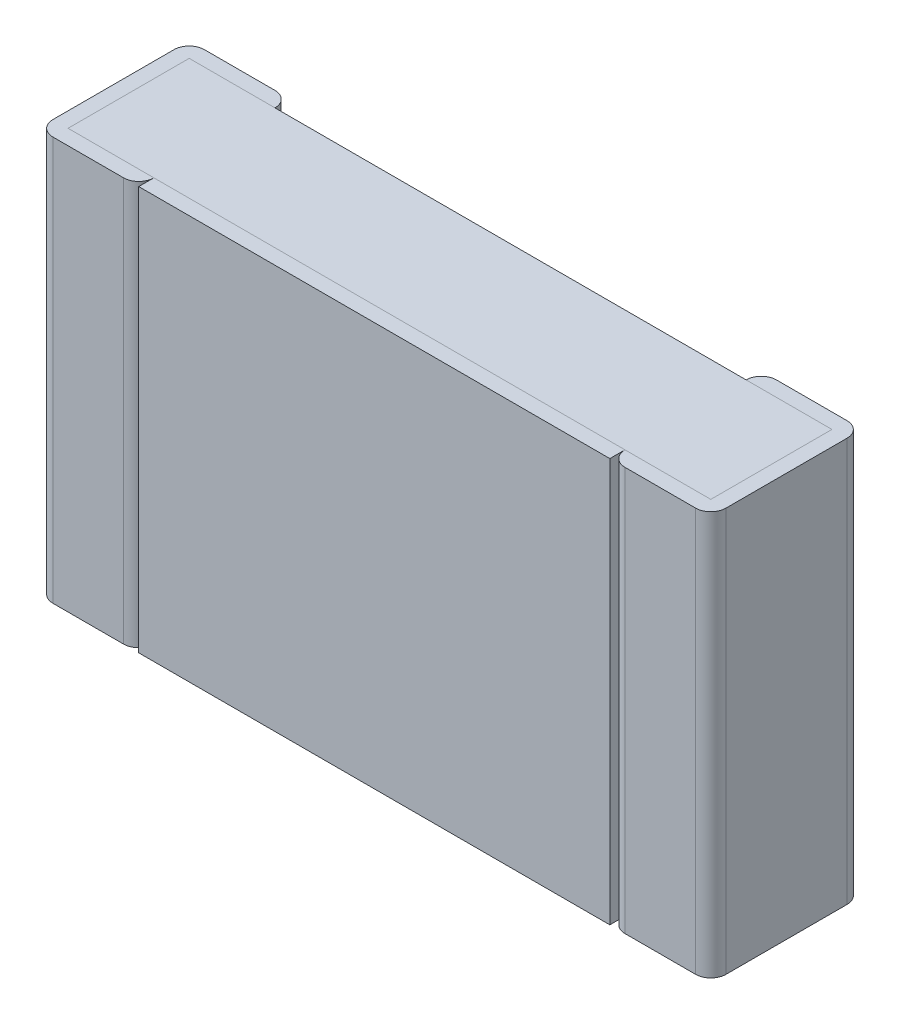
ISO-10303-21;
HEADER;
FILE_DESCRIPTION(('STEP AP214'),'2;1');
FILE_NAME('part.step','',(''),(''),'','','');
FILE_SCHEMA(('AUTOMOTIVE_DESIGN { 1 0 10303 214 1 1 1 1 }'));
ENDSEC;
DATA;
#1=APPLICATION_CONTEXT('core data for automotive mechanical design processes');
#2=APPLICATION_PROTOCOL_DEFINITION('international standard','automotive_design',2000,#1);
#3=PRODUCT_CONTEXT('',#1,'mechanical');
#4=PRODUCT('Part','Part','',(#3));
#5=PRODUCT_RELATED_PRODUCT_CATEGORY('part','',(#4));
#6=PRODUCT_DEFINITION_FORMATION('','',#4);
#7=PRODUCT_DEFINITION_CONTEXT('part definition',#1,'design');
#8=PRODUCT_DEFINITION('design','',#6,#7);
#9=PRODUCT_DEFINITION_SHAPE('','',#8);
#10=(LENGTH_UNIT() NAMED_UNIT(*) SI_UNIT(.MILLI.,.METRE.));
#11=(NAMED_UNIT(*) PLANE_ANGLE_UNIT() SI_UNIT($,.RADIAN.));
#12=(NAMED_UNIT(*) SI_UNIT($,.STERADIAN.) SOLID_ANGLE_UNIT());
#13=UNCERTAINTY_MEASURE_WITH_UNIT(LENGTH_MEASURE(1.E-05),#10,'distance_accuracy_value','');
#14=(GEOMETRIC_REPRESENTATION_CONTEXT(3) GLOBAL_UNCERTAINTY_ASSIGNED_CONTEXT((#13)) GLOBAL_UNIT_ASSIGNED_CONTEXT((#10,
#11,#12)) REPRESENTATION_CONTEXT('',''));
#15=CARTESIAN_POINT('',(0.,0.,0.));
#16=DIRECTION('',(0.,0.,1.));
#17=DIRECTION('',(1.,0.,0.));
#18=AXIS2_PLACEMENT_3D('',#15,#16,#17);
#19=CARTESIAN_POINT('',(-1.,-0.6,0.));
#20=DIRECTION('',(1.,0.,0.));
#21=DIRECTION('',(0.,1.,0.));
#22=AXIS2_PLACEMENT_3D('',#19,#20,#21);
#23=PLANE('',#22);
#24=DIRECTION('',(0.,1.,0.));
#25=VECTOR('',#24,1.);
#26=CARTESIAN_POINT('',(-1.,-0.6,0.405));
#27=LINE('',#26,#25);
#28=CARTESIAN_POINT('',(-1.,-0.6,0.405));
#29=VERTEX_POINT('',#28);
#30=CARTESIAN_POINT('',(-1.,0.6,0.405));
#31=VERTEX_POINT('',#30);
#32=EDGE_CURVE('E11',#29,#31,#27,.T.);
#33=ORIENTED_EDGE('',*,*,#32,.T.);
#34=DIRECTION('',(0.,0.,1.));
#35=VECTOR('',#34,1.);
#36=CARTESIAN_POINT('',(-1.,0.6,0.));
#37=LINE('',#36,#35);
#38=CARTESIAN_POINT('',(-1.,0.6,0.045));
#39=VERTEX_POINT('',#38);
#40=EDGE_CURVE('E41',#39,#31,#37,.T.);
#41=ORIENTED_EDGE('',*,*,#40,.F.);
#42=DIRECTION('',(0.,1.,0.));
#43=VECTOR('',#42,1.);
#44=CARTESIAN_POINT('',(-1.,-0.6,0.045));
#45=LINE('',#44,#43);
#46=CARTESIAN_POINT('',(-1.,-0.6,0.045));
#47=VERTEX_POINT('',#46);
#48=EDGE_CURVE('E377',#47,#39,#45,.T.);
#49=ORIENTED_EDGE('',*,*,#48,.F.);
#50=DIRECTION('',(0.,0.,1.));
#51=VECTOR('',#50,1.);
#52=CARTESIAN_POINT('',(-1.,-0.6,0.));
#53=LINE('',#52,#51);
#54=EDGE_CURVE('E27',#47,#29,#53,.T.);
#55=ORIENTED_EDGE('',*,*,#54,.T.);
#56=EDGE_LOOP('',(#33,#41,#49,#55));
#57=FACE_BOUND('',#56,.T.);
#58=ADVANCED_FACE('F16',(#57),#23,.F.);
#59=CARTESIAN_POINT('',(-1.,-0.6,0.));
#60=DIRECTION('',(0.,1.,0.));
#61=DIRECTION('',(1.,0.,0.));
#62=AXIS2_PLACEMENT_3D('',#59,#60,#61);
#63=PLANE('',#62);
#64=CARTESIAN_POINT('',(-0.745,-0.6,0.045));
#65=DIRECTION('',(0.,1.,0.));
#66=DIRECTION('',(0.,0.,1.));
#67=AXIS2_PLACEMENT_3D('',#64,#65,#66);
#68=CIRCLE('',#67,0.045);
#69=CARTESIAN_POINT('',(-0.7,-0.6,0.045));
#70=VERTEX_POINT('',#69);
#71=CARTESIAN_POINT('',(-0.745,-0.6,0.));
#72=VERTEX_POINT('',#71);
#73=EDGE_CURVE('E397',#70,#72,#68,.T.);
#74=ORIENTED_EDGE('',*,*,#73,.F.);
#75=DIRECTION('',(1.,0.,0.));
#76=VECTOR('',#75,1.);
#77=CARTESIAN_POINT('',(-0.955,-0.6,0.045));
#78=LINE('',#77,#76);
#79=CARTESIAN_POINT('',(-0.955,-0.6,0.045));
#80=VERTEX_POINT('',#79);
#81=EDGE_CURVE('E321',#80,#70,#78,.T.);
#82=ORIENTED_EDGE('',*,*,#81,.F.);
#83=DIRECTION('',(0.,0.,1.));
#84=VECTOR('',#83,1.);
#85=CARTESIAN_POINT('',(-0.955,-0.6,0.045));
#86=LINE('',#85,#84);
#87=CARTESIAN_POINT('',(-0.955,-0.6,0.405));
#88=VERTEX_POINT('',#87);
#89=EDGE_CURVE('E363',#80,#88,#86,.T.);
#90=ORIENTED_EDGE('',*,*,#89,.T.);
#91=DIRECTION('',(1.,0.,0.));
#92=VECTOR('',#91,1.);
#93=CARTESIAN_POINT('',(-0.955,-0.6,0.405));
#94=LINE('',#93,#92);
#95=CARTESIAN_POINT('',(-0.7,-0.6,0.405));
#96=VERTEX_POINT('',#95);
#97=EDGE_CURVE('E445',#88,#96,#94,.T.);
#98=ORIENTED_EDGE('',*,*,#97,.T.);
#99=CARTESIAN_POINT('',(-0.745,-0.6,0.405));
#100=DIRECTION('',(0.,-1.,0.));
#101=DIRECTION('',(0.,0.,1.));
#102=AXIS2_PLACEMENT_3D('',#99,#100,#101);
#103=CIRCLE('',#102,0.045);
#104=CARTESIAN_POINT('',(-0.745,-0.6,0.45));
#105=VERTEX_POINT('',#104);
#106=EDGE_CURVE('E293',#96,#105,#103,.T.);
#107=ORIENTED_EDGE('',*,*,#106,.T.);
#108=DIRECTION('',(1.,0.,0.));
#109=VECTOR('',#108,1.);
#110=CARTESIAN_POINT('',(-1.,-0.6,0.45));
#111=LINE('',#110,#109);
#112=CARTESIAN_POINT('',(-0.955,-0.6,0.45));
#113=VERTEX_POINT('',#112);
#114=EDGE_CURVE('E304',#113,#105,#111,.T.);
#115=ORIENTED_EDGE('',*,*,#114,.F.);
#116=CARTESIAN_POINT('',(-0.955,-0.6,0.405));
#117=DIRECTION('',(0.,1.,0.));
#118=DIRECTION('',(0.,0.,1.));
#119=AXIS2_PLACEMENT_3D('',#116,#117,#118);
#120=CIRCLE('',#119,0.045);
#121=EDGE_CURVE('E340',#29,#113,#120,.T.);
#122=ORIENTED_EDGE('',*,*,#121,.F.);
#123=ORIENTED_EDGE('',*,*,#54,.F.);
#124=CARTESIAN_POINT('',(-0.955,-0.6,0.045));
#125=DIRECTION('',(0.,-1.,0.));
#126=DIRECTION('',(0.,0.,1.));
#127=AXIS2_PLACEMENT_3D('',#124,#125,#126);
#128=CIRCLE('',#127,0.045);
#129=CARTESIAN_POINT('',(-0.955,-0.6,0.));
#130=VERTEX_POINT('',#129);
#131=EDGE_CURVE('E290',#47,#130,#128,.T.);
#132=ORIENTED_EDGE('',*,*,#131,.T.);
#133=DIRECTION('',(1.,0.,0.));
#134=VECTOR('',#133,1.);
#135=CARTESIAN_POINT('',(-1.,-0.6,0.));
#136=LINE('',#135,#134);
#137=EDGE_CURVE('E294',#130,#72,#136,.T.);
#138=ORIENTED_EDGE('',*,*,#137,.T.);
#139=EDGE_LOOP('',(#74,#82,#90,#98,#107,#115,#122,#123,#132,#138));
#140=FACE_BOUND('',#139,.T.);
#141=ADVANCED_FACE('F479',(#140),#63,.F.);
#142=CARTESIAN_POINT('',(-0.955,-0.6,0.045));
#143=DIRECTION('',(0.,1.,0.));
#144=DIRECTION('',(-1.,0.,0.));
#145=AXIS2_PLACEMENT_3D('',#142,#143,#144);
#146=CYLINDRICAL_SURFACE('',#145,0.045);
#147=ORIENTED_EDGE('',*,*,#48,.T.);
#148=CARTESIAN_POINT('',(-0.955,0.6,0.045));
#149=DIRECTION('',(0.,-1.,0.));
#150=DIRECTION('',(0.,0.,1.));
#151=AXIS2_PLACEMENT_3D('',#148,#149,#150);
#152=CIRCLE('',#151,0.045);
#153=CARTESIAN_POINT('',(-0.955,0.6,0.));
#154=VERTEX_POINT('',#153);
#155=EDGE_CURVE('E344',#39,#154,#152,.T.);
#156=ORIENTED_EDGE('',*,*,#155,.T.);
#157=DIRECTION('',(0.,1.,0.));
#158=VECTOR('',#157,1.);
#159=CARTESIAN_POINT('',(-0.955,-0.6,0.));
#160=LINE('',#159,#158);
#161=EDGE_CURVE('E330',#130,#154,#160,.T.);
#162=ORIENTED_EDGE('',*,*,#161,.F.);
#163=ORIENTED_EDGE('',*,*,#131,.F.);
#164=EDGE_LOOP('',(#147,#156,#162,#163));
#165=FACE_BOUND('',#164,.T.);
#166=ADVANCED_FACE('F495',(#165),#146,.T.);
#167=CARTESIAN_POINT('',(-0.955,-0.6,0.405));
#168=DIRECTION('',(0.,1.,0.));
#169=DIRECTION('',(-1.,0.,0.));
#170=AXIS2_PLACEMENT_3D('',#167,#168,#169);
#171=CYLINDRICAL_SURFACE('',#170,0.045);
#172=ORIENTED_EDGE('',*,*,#121,.T.);
#173=DIRECTION('',(0.,1.,0.));
#174=VECTOR('',#173,1.);
#175=CARTESIAN_POINT('',(-0.955,-0.6,0.45));
#176=LINE('',#175,#174);
#177=CARTESIAN_POINT('',(-0.955,0.6,0.45));
#178=VERTEX_POINT('',#177);
#179=EDGE_CURVE('E276',#113,#178,#176,.T.);
#180=ORIENTED_EDGE('',*,*,#179,.T.);
#181=CARTESIAN_POINT('',(-0.955,0.6,0.405));
#182=DIRECTION('',(0.,1.,0.));
#183=DIRECTION('',(0.,0.,1.));
#184=AXIS2_PLACEMENT_3D('',#181,#182,#183);
#185=CIRCLE('',#184,0.045);
#186=EDGE_CURVE('E267',#31,#178,#185,.T.);
#187=ORIENTED_EDGE('',*,*,#186,.F.);
#188=ORIENTED_EDGE('',*,*,#32,.F.);
#189=EDGE_LOOP('',(#172,#180,#187,#188));
#190=FACE_BOUND('',#189,.T.);
#191=ADVANCED_FACE('F488',(#190),#171,.T.);
#192=CARTESIAN_POINT('',(-1.,0.6,0.));
#193=DIRECTION('',(0.,1.,0.));
#194=DIRECTION('',(1.,0.,0.));
#195=AXIS2_PLACEMENT_3D('',#192,#193,#194);
#196=PLANE('',#195);
#197=DIRECTION('',(1.,0.,0.));
#198=VECTOR('',#197,1.);
#199=CARTESIAN_POINT('',(-1.,0.6,0.));
#200=LINE('',#199,#198);
#201=CARTESIAN_POINT('',(-0.745,0.6,0.));
#202=VERTEX_POINT('',#201);
#203=EDGE_CURVE('E332',#154,#202,#200,.T.);
#204=ORIENTED_EDGE('',*,*,#203,.F.);
#205=ORIENTED_EDGE('',*,*,#155,.F.);
#206=ORIENTED_EDGE('',*,*,#40,.T.);
#207=ORIENTED_EDGE('',*,*,#186,.T.);
#208=DIRECTION('',(1.,0.,0.));
#209=VECTOR('',#208,1.);
#210=CARTESIAN_POINT('',(-1.,0.6,0.45));
#211=LINE('',#210,#209);
#212=CARTESIAN_POINT('',(-0.745,0.6,0.45));
#213=VERTEX_POINT('',#212);
#214=EDGE_CURVE('E269',#178,#213,#211,.T.);
#215=ORIENTED_EDGE('',*,*,#214,.T.);
#216=CARTESIAN_POINT('',(-0.745,0.6,0.405));
#217=DIRECTION('',(0.,-1.,0.));
#218=DIRECTION('',(0.,0.,1.));
#219=AXIS2_PLACEMENT_3D('',#216,#217,#218);
#220=CIRCLE('',#219,0.045);
#221=CARTESIAN_POINT('',(-0.7,0.6,0.405));
#222=VERTEX_POINT('',#221);
#223=EDGE_CURVE('E338',#222,#213,#220,.T.);
#224=ORIENTED_EDGE('',*,*,#223,.F.);
#225=DIRECTION('',(1.,0.,0.));
#226=VECTOR('',#225,1.);
#227=CARTESIAN_POINT('',(-0.955,0.6,0.405));
#228=LINE('',#227,#226);
#229=CARTESIAN_POINT('',(-0.955,0.6,0.405));
#230=VERTEX_POINT('',#229);
#231=EDGE_CURVE('E339',#230,#222,#228,.T.);
#232=ORIENTED_EDGE('',*,*,#231,.F.);
#233=DIRECTION('',(0.,0.,1.));
#234=VECTOR('',#233,1.);
#235=CARTESIAN_POINT('',(-0.955,0.6,0.045));
#236=LINE('',#235,#234);
#237=CARTESIAN_POINT('',(-0.955,0.6,0.045));
#238=VERTEX_POINT('',#237);
#239=EDGE_CURVE('E334',#238,#230,#236,.T.);
#240=ORIENTED_EDGE('',*,*,#239,.F.);
#241=DIRECTION('',(1.,0.,0.));
#242=VECTOR('',#241,1.);
#243=CARTESIAN_POINT('',(-0.955,0.6,0.045));
#244=LINE('',#243,#242);
#245=CARTESIAN_POINT('',(-0.7,0.6,0.045));
#246=VERTEX_POINT('',#245);
#247=EDGE_CURVE('E279',#238,#246,#244,.T.);
#248=ORIENTED_EDGE('',*,*,#247,.T.);
#249=CARTESIAN_POINT('',(-0.745,0.6,0.045));
#250=DIRECTION('',(0.,1.,0.));
#251=DIRECTION('',(0.,0.,1.));
#252=AXIS2_PLACEMENT_3D('',#249,#250,#251);
#253=CIRCLE('',#252,0.045);
#254=EDGE_CURVE('E287',#246,#202,#253,.T.);
#255=ORIENTED_EDGE('',*,*,#254,.T.);
#256=EDGE_LOOP('',(#204,#205,#206,#207,#215,#224,#232,#240,#248,#255));
#257=FACE_BOUND('',#256,.T.);
#258=ADVANCED_FACE('F498',(#257),#196,.T.);
#259=CARTESIAN_POINT('',(-1.,-0.6,0.));
#260=DIRECTION('',(0.,0.,1.));
#261=DIRECTION('',(1.,0.,0.));
#262=AXIS2_PLACEMENT_3D('',#259,#260,#261);
#263=PLANE('',#262);
#264=DIRECTION('',(0.,1.,0.));
#265=VECTOR('',#264,1.);
#266=CARTESIAN_POINT('',(-0.745,-0.6,0.));
#267=LINE('',#266,#265);
#268=EDGE_CURVE('E401',#72,#202,#267,.T.);
#269=ORIENTED_EDGE('',*,*,#268,.F.);
#270=ORIENTED_EDGE('',*,*,#137,.F.);
#271=ORIENTED_EDGE('',*,*,#161,.T.);
#272=ORIENTED_EDGE('',*,*,#203,.T.);
#273=EDGE_LOOP('',(#269,#270,#271,#272));
#274=FACE_BOUND('',#273,.T.);
#275=ADVANCED_FACE('F502',(#274),#263,.F.);
#276=CARTESIAN_POINT('',(-0.745,-0.6,0.045));
#277=DIRECTION('',(0.,1.,0.));
#278=DIRECTION('',(1.,0.,0.));
#279=AXIS2_PLACEMENT_3D('',#276,#277,#278);
#280=CYLINDRICAL_SURFACE('',#279,0.045);
#281=ORIENTED_EDGE('',*,*,#73,.T.);
#282=ORIENTED_EDGE('',*,*,#268,.T.);
#283=ORIENTED_EDGE('',*,*,#254,.F.);
#284=DIRECTION('',(0.,1.,0.));
#285=VECTOR('',#284,1.);
#286=CARTESIAN_POINT('',(-0.7,-0.6,0.045));
#287=LINE('',#286,#285);
#288=EDGE_CURVE('E318',#70,#246,#287,.T.);
#289=ORIENTED_EDGE('',*,*,#288,.F.);
#290=EDGE_LOOP('',(#281,#282,#283,#289));
#291=FACE_BOUND('',#290,.T.);
#292=ADVANCED_FACE('F507',(#291),#280,.T.);
#293=CARTESIAN_POINT('',(-0.955,-0.6,0.045));
#294=DIRECTION('',(0.,1.,0.));
#295=DIRECTION('',(1.,0.,0.));
#296=AXIS2_PLACEMENT_3D('',#293,#294,#295);
#297=PLANE('',#296);
#298=DIRECTION('',(1.,0.,0.));
#299=VECTOR('',#298,1.);
#300=CARTESIAN_POINT('',(-0.955,-0.6,0.045));
#301=LINE('',#300,#299);
#302=CARTESIAN_POINT('',(0.7,-0.6,0.045));
#303=VERTEX_POINT('',#302);
#304=EDGE_CURVE('E391',#70,#303,#301,.T.);
#305=ORIENTED_EDGE('',*,*,#304,.T.);
#306=DIRECTION('',(1.,0.,0.));
#307=VECTOR('',#306,1.);
#308=CARTESIAN_POINT('',(-0.955,-0.6,0.045));
#309=LINE('',#308,#307);
#310=CARTESIAN_POINT('',(0.955,-0.6,0.045));
#311=VERTEX_POINT('',#310);
#312=EDGE_CURVE('E325',#303,#311,#309,.T.);
#313=ORIENTED_EDGE('',*,*,#312,.T.);
#314=DIRECTION('',(0.,0.,1.));
#315=VECTOR('',#314,1.);
#316=CARTESIAN_POINT('',(0.955,-0.6,0.045));
#317=LINE('',#316,#315);
#318=CARTESIAN_POINT('',(0.955,-0.6,0.405));
#319=VERTEX_POINT('',#318);
#320=EDGE_CURVE('E322',#311,#319,#317,.T.);
#321=ORIENTED_EDGE('',*,*,#320,.T.);
#322=DIRECTION('',(1.,0.,0.));
#323=VECTOR('',#322,1.);
#324=CARTESIAN_POINT('',(-0.955,-0.6,0.405));
#325=LINE('',#324,#323);
#326=CARTESIAN_POINT('',(0.7,-0.6,0.405));
#327=VERTEX_POINT('',#326);
#328=EDGE_CURVE('E299',#327,#319,#325,.T.);
#329=ORIENTED_EDGE('',*,*,#328,.F.);
#330=DIRECTION('',(1.,0.,0.));
#331=VECTOR('',#330,1.);
#332=CARTESIAN_POINT('',(-0.7,-0.6,0.405));
#333=LINE('',#332,#331);
#334=EDGE_CURVE('E252',#96,#327,#333,.T.);
#335=ORIENTED_EDGE('',*,*,#334,.F.);
#336=ORIENTED_EDGE('',*,*,#97,.F.);
#337=ORIENTED_EDGE('',*,*,#89,.F.);
#338=ORIENTED_EDGE('',*,*,#81,.T.);
#339=EDGE_LOOP('',(#305,#313,#321,#329,#335,#336,#337,#338));
#340=FACE_BOUND('',#339,.T.);
#341=ADVANCED_FACE('F511',(#340),#297,.F.);
#342=CARTESIAN_POINT('',(-1.,-0.6,0.45));
#343=DIRECTION('',(0.,0.,1.));
#344=DIRECTION('',(1.,0.,0.));
#345=AXIS2_PLACEMENT_3D('',#342,#343,#344);
#346=PLANE('',#345);
#347=ORIENTED_EDGE('',*,*,#214,.F.);
#348=ORIENTED_EDGE('',*,*,#179,.F.);
#349=ORIENTED_EDGE('',*,*,#114,.T.);
#350=DIRECTION('',(0.,1.,0.));
#351=VECTOR('',#350,1.);
#352=CARTESIAN_POINT('',(-0.745,-0.6,0.45));
#353=LINE('',#352,#351);
#354=EDGE_CURVE('E301',#105,#213,#353,.T.);
#355=ORIENTED_EDGE('',*,*,#354,.T.);
#356=EDGE_LOOP('',(#347,#348,#349,#355));
#357=FACE_BOUND('',#356,.T.);
#358=ADVANCED_FACE('F485',(#357),#346,.T.);
#359=CARTESIAN_POINT('',(-0.745,-0.6,0.405));
#360=DIRECTION('',(0.,1.,0.));
#361=DIRECTION('',(1.,0.,0.));
#362=AXIS2_PLACEMENT_3D('',#359,#360,#361);
#363=CYLINDRICAL_SURFACE('',#362,0.045);
#364=DIRECTION('',(0.,1.,0.));
#365=VECTOR('',#364,1.);
#366=CARTESIAN_POINT('',(-0.7,-0.6,0.405));
#367=LINE('',#366,#365);
#368=EDGE_CURVE('E243',#96,#222,#367,.T.);
#369=ORIENTED_EDGE('',*,*,#368,.T.);
#370=ORIENTED_EDGE('',*,*,#223,.T.);
#371=ORIENTED_EDGE('',*,*,#354,.F.);
#372=ORIENTED_EDGE('',*,*,#106,.F.);
#373=EDGE_LOOP('',(#369,#370,#371,#372));
#374=FACE_BOUND('',#373,.T.);
#375=ADVANCED_FACE('F483',(#374),#363,.T.);
#376=CARTESIAN_POINT('',(-0.955,0.6,0.045));
#377=DIRECTION('',(0.,1.,0.));
#378=DIRECTION('',(1.,0.,0.));
#379=AXIS2_PLACEMENT_3D('',#376,#377,#378);
#380=PLANE('',#379);
#381=ORIENTED_EDGE('',*,*,#247,.F.);
#382=ORIENTED_EDGE('',*,*,#239,.T.);
#383=ORIENTED_EDGE('',*,*,#231,.T.);
#384=DIRECTION('',(1.,0.,0.));
#385=VECTOR('',#384,1.);
#386=CARTESIAN_POINT('',(-0.7,0.6,0.405));
#387=LINE('',#386,#385);
#388=CARTESIAN_POINT('',(0.7,0.6,0.405));
#389=VERTEX_POINT('',#388);
#390=EDGE_CURVE('E385',#222,#389,#387,.T.);
#391=ORIENTED_EDGE('',*,*,#390,.T.);
#392=DIRECTION('',(1.,0.,0.));
#393=VECTOR('',#392,1.);
#394=CARTESIAN_POINT('',(-0.955,0.6,0.405));
#395=LINE('',#394,#393);
#396=CARTESIAN_POINT('',(0.955,0.6,0.405));
#397=VERTEX_POINT('',#396);
#398=EDGE_CURVE('E261',#389,#397,#395,.T.);
#399=ORIENTED_EDGE('',*,*,#398,.T.);
#400=DIRECTION('',(0.,0.,1.));
#401=VECTOR('',#400,1.);
#402=CARTESIAN_POINT('',(0.955,0.6,0.045));
#403=LINE('',#402,#401);
#404=CARTESIAN_POINT('',(0.955,0.6,0.045));
#405=VERTEX_POINT('',#404);
#406=EDGE_CURVE('E310',#405,#397,#403,.T.);
#407=ORIENTED_EDGE('',*,*,#406,.F.);
#408=DIRECTION('',(1.,0.,0.));
#409=VECTOR('',#408,1.);
#410=CARTESIAN_POINT('',(-0.955,0.6,0.045));
#411=LINE('',#410,#409);
#412=CARTESIAN_POINT('',(0.7,0.6,0.045));
#413=VERTEX_POINT('',#412);
#414=EDGE_CURVE('E246',#413,#405,#411,.T.);
#415=ORIENTED_EDGE('',*,*,#414,.F.);
#416=DIRECTION('',(1.,0.,0.));
#417=VECTOR('',#416,1.);
#418=CARTESIAN_POINT('',(-0.955,0.6,0.045));
#419=LINE('',#418,#417);
#420=EDGE_CURVE('E349',#246,#413,#419,.T.);
#421=ORIENTED_EDGE('',*,*,#420,.F.);
#422=EDGE_LOOP('',(#381,#382,#383,#391,#399,#407,#415,#421));
#423=FACE_BOUND('',#422,.T.);
#424=ADVANCED_FACE('F522',(#423),#380,.T.);
#425=CARTESIAN_POINT('',(-0.955,-0.6,0.045));
#426=DIRECTION('',(0.,0.,1.));
#427=DIRECTION('',(1.,0.,0.));
#428=AXIS2_PLACEMENT_3D('',#425,#426,#427);
#429=PLANE('',#428);
#430=ORIENTED_EDGE('',*,*,#420,.T.);
#431=DIRECTION('',(0.,1.,0.));
#432=VECTOR('',#431,1.);
#433=CARTESIAN_POINT('',(0.7,-0.6,0.045));
#434=LINE('',#433,#432);
#435=EDGE_CURVE('E345',#303,#413,#434,.T.);
#436=ORIENTED_EDGE('',*,*,#435,.F.);
#437=ORIENTED_EDGE('',*,*,#304,.F.);
#438=ORIENTED_EDGE('',*,*,#288,.T.);
#439=EDGE_LOOP('',(#430,#436,#437,#438));
#440=FACE_BOUND('',#439,.T.);
#441=ADVANCED_FACE('F526',(#440),#429,.F.);
#442=CARTESIAN_POINT('',(0.7,-0.6,0.));
#443=DIRECTION('',(0.,1.,0.));
#444=DIRECTION('',(1.,0.,0.));
#445=AXIS2_PLACEMENT_3D('',#442,#443,#444);
#446=PLANE('',#445);
#447=CARTESIAN_POINT('',(0.955,-0.6,0.045));
#448=DIRECTION('',(0.,1.,0.));
#449=DIRECTION('',(0.,0.,1.));
#450=AXIS2_PLACEMENT_3D('',#447,#448,#449);
#451=CIRCLE('',#450,0.045);
#452=CARTESIAN_POINT('',(1.,-0.6,0.045));
#453=VERTEX_POINT('',#452);
#454=CARTESIAN_POINT('',(0.955,-0.6,0.));
#455=VERTEX_POINT('',#454);
#456=EDGE_CURVE('E356',#453,#455,#451,.T.);
#457=ORIENTED_EDGE('',*,*,#456,.F.);
#458=DIRECTION('',(0.,0.,1.));
#459=VECTOR('',#458,1.);
#460=CARTESIAN_POINT('',(1.,-0.6,0.));
#461=LINE('',#460,#459);
#462=CARTESIAN_POINT('',(1.,-0.6,0.405));
#463=VERTEX_POINT('',#462);
#464=EDGE_CURVE('E309',#453,#463,#461,.T.);
#465=ORIENTED_EDGE('',*,*,#464,.T.);
#466=CARTESIAN_POINT('',(0.955,-0.6,0.405));
#467=DIRECTION('',(0.,-1.,0.));
#468=DIRECTION('',(0.,0.,1.));
#469=AXIS2_PLACEMENT_3D('',#466,#467,#468);
#470=CIRCLE('',#469,0.045);
#471=CARTESIAN_POINT('',(0.955,-0.6,0.45));
#472=VERTEX_POINT('',#471);
#473=EDGE_CURVE('E305',#463,#472,#470,.T.);
#474=ORIENTED_EDGE('',*,*,#473,.T.);
#475=DIRECTION('',(1.,0.,0.));
#476=VECTOR('',#475,1.);
#477=CARTESIAN_POINT('',(0.7,-0.6,0.45));
#478=LINE('',#477,#476);
#479=CARTESIAN_POINT('',(0.745,-0.6,0.45));
#480=VERTEX_POINT('',#479);
#481=EDGE_CURVE('E326',#480,#472,#478,.T.);
#482=ORIENTED_EDGE('',*,*,#481,.F.);
#483=CARTESIAN_POINT('',(0.745,-0.6,0.405));
#484=DIRECTION('',(0.,1.,0.));
#485=DIRECTION('',(0.,0.,1.));
#486=AXIS2_PLACEMENT_3D('',#483,#484,#485);
#487=CIRCLE('',#486,0.045);
#488=EDGE_CURVE('E378',#327,#480,#487,.T.);
#489=ORIENTED_EDGE('',*,*,#488,.F.);
#490=ORIENTED_EDGE('',*,*,#328,.T.);
#491=ORIENTED_EDGE('',*,*,#320,.F.);
#492=ORIENTED_EDGE('',*,*,#312,.F.);
#493=CARTESIAN_POINT('',(0.745,-0.6,0.045));
#494=DIRECTION('',(0.,-1.,0.));
#495=DIRECTION('',(0.,0.,1.));
#496=AXIS2_PLACEMENT_3D('',#493,#494,#495);
#497=CIRCLE('',#496,0.045);
#498=CARTESIAN_POINT('',(0.745,-0.6,0.));
#499=VERTEX_POINT('',#498);
#500=EDGE_CURVE('E295',#303,#499,#497,.T.);
#501=ORIENTED_EDGE('',*,*,#500,.T.);
#502=DIRECTION('',(1.,0.,0.));
#503=VECTOR('',#502,1.);
#504=CARTESIAN_POINT('',(0.7,-0.6,0.));
#505=LINE('',#504,#503);
#506=EDGE_CURVE('E300',#499,#455,#505,.T.);
#507=ORIENTED_EDGE('',*,*,#506,.T.);
#508=EDGE_LOOP('',(#457,#465,#474,#482,#489,#490,#491,#492,#501,#507));
#509=FACE_BOUND('',#508,.T.);
#510=ADVANCED_FACE('F536',(#509),#446,.F.);
#511=CARTESIAN_POINT('',(-0.7,-0.6,0.405));
#512=DIRECTION('',(0.,1.,0.));
#513=DIRECTION('',(1.,0.,0.));
#514=AXIS2_PLACEMENT_3D('',#511,#512,#513);
#515=PLANE('',#514);
#516=DIRECTION('',(0.,0.,1.));
#517=VECTOR('',#516,1.);
#518=CARTESIAN_POINT('',(0.7,-0.6,0.405));
#519=LINE('',#518,#517);
#520=CARTESIAN_POINT('',(0.7,-0.6,0.45));
#521=VERTEX_POINT('',#520);
#522=EDGE_CURVE('E226',#327,#521,#519,.T.);
#523=ORIENTED_EDGE('',*,*,#522,.T.);
#524=DIRECTION('',(1.,0.,0.));
#525=VECTOR('',#524,1.);
#526=CARTESIAN_POINT('',(-0.7,-0.6,0.45));
#527=LINE('',#526,#525);
#528=CARTESIAN_POINT('',(-0.7,-0.6,0.45));
#529=VERTEX_POINT('',#528);
#530=EDGE_CURVE('E220',#529,#521,#527,.T.);
#531=ORIENTED_EDGE('',*,*,#530,.F.);
#532=DIRECTION('',(0.,0.,1.));
#533=VECTOR('',#532,1.);
#534=CARTESIAN_POINT('',(-0.7,-0.6,0.405));
#535=LINE('',#534,#533);
#536=EDGE_CURVE('E224',#96,#529,#535,.T.);
#537=ORIENTED_EDGE('',*,*,#536,.F.);
#538=ORIENTED_EDGE('',*,*,#334,.T.);
#539=EDGE_LOOP('',(#523,#531,#537,#538));
#540=FACE_BOUND('',#539,.T.);
#541=ADVANCED_FACE('F222',(#540),#515,.F.);
#542=CARTESIAN_POINT('',(-0.7,-0.6,0.405));
#543=DIRECTION('',(1.,0.,0.));
#544=DIRECTION('',(0.,1.,0.));
#545=AXIS2_PLACEMENT_3D('',#542,#543,#544);
#546=PLANE('',#545);
#547=DIRECTION('',(0.,1.,0.));
#548=VECTOR('',#547,1.);
#549=CARTESIAN_POINT('',(-0.7,-0.6,0.45));
#550=LINE('',#549,#548);
#551=CARTESIAN_POINT('',(-0.7,0.6,0.45));
#552=VERTEX_POINT('',#551);
#553=EDGE_CURVE('E240',#529,#552,#550,.T.);
#554=ORIENTED_EDGE('',*,*,#553,.T.);
#555=DIRECTION('',(0.,0.,1.));
#556=VECTOR('',#555,1.);
#557=CARTESIAN_POINT('',(-0.7,0.6,0.405));
#558=LINE('',#557,#556);
#559=EDGE_CURVE('E366',#222,#552,#558,.T.);
#560=ORIENTED_EDGE('',*,*,#559,.F.);
#561=ORIENTED_EDGE('',*,*,#368,.F.);
#562=ORIENTED_EDGE('',*,*,#536,.T.);
#563=EDGE_LOOP('',(#554,#560,#561,#562));
#564=FACE_BOUND('',#563,.T.);
#565=ADVANCED_FACE('F238',(#564),#546,.F.);
#566=CARTESIAN_POINT('',(0.7,0.6,0.));
#567=DIRECTION('',(0.,1.,0.));
#568=DIRECTION('',(1.,0.,0.));
#569=AXIS2_PLACEMENT_3D('',#566,#567,#568);
#570=PLANE('',#569);
#571=DIRECTION('',(1.,0.,0.));
#572=VECTOR('',#571,1.);
#573=CARTESIAN_POINT('',(0.7,0.6,0.));
#574=LINE('',#573,#572);
#575=CARTESIAN_POINT('',(0.745,0.6,0.));
#576=VERTEX_POINT('',#575);
#577=CARTESIAN_POINT('',(0.955,0.6,0.));
#578=VERTEX_POINT('',#577);
#579=EDGE_CURVE('E359',#576,#578,#574,.T.);
#580=ORIENTED_EDGE('',*,*,#579,.F.);
#581=CARTESIAN_POINT('',(0.745,0.6,0.045));
#582=DIRECTION('',(0.,-1.,0.));
#583=DIRECTION('',(0.,0.,1.));
#584=AXIS2_PLACEMENT_3D('',#581,#582,#583);
#585=CIRCLE('',#584,0.045);
#586=EDGE_CURVE('E348',#413,#576,#585,.T.);
#587=ORIENTED_EDGE('',*,*,#586,.F.);
#588=ORIENTED_EDGE('',*,*,#414,.T.);
#589=ORIENTED_EDGE('',*,*,#406,.T.);
#590=ORIENTED_EDGE('',*,*,#398,.F.);
#591=CARTESIAN_POINT('',(0.745,0.6,0.405));
#592=DIRECTION('',(0.,1.,0.));
#593=DIRECTION('',(0.,0.,1.));
#594=AXIS2_PLACEMENT_3D('',#591,#592,#593);
#595=CIRCLE('',#594,0.045);
#596=CARTESIAN_POINT('',(0.745,0.6,0.45));
#597=VERTEX_POINT('',#596);
#598=EDGE_CURVE('E313',#389,#597,#595,.T.);
#599=ORIENTED_EDGE('',*,*,#598,.T.);
#600=DIRECTION('',(1.,0.,0.));
#601=VECTOR('',#600,1.);
#602=CARTESIAN_POINT('',(0.7,0.6,0.45));
#603=LINE('',#602,#601);
#604=CARTESIAN_POINT('',(0.955,0.6,0.45));
#605=VERTEX_POINT('',#604);
#606=EDGE_CURVE('E20',#597,#605,#603,.T.);
#607=ORIENTED_EDGE('',*,*,#606,.T.);
#608=CARTESIAN_POINT('',(0.955,0.6,0.405));
#609=DIRECTION('',(0.,-1.,0.));
#610=DIRECTION('',(0.,0.,1.));
#611=AXIS2_PLACEMENT_3D('',#608,#609,#610);
#612=CIRCLE('',#611,0.045);
#613=CARTESIAN_POINT('',(1.,0.6,0.405));
#614=VERTEX_POINT('',#613);
#615=EDGE_CURVE('E194',#614,#605,#612,.T.);
#616=ORIENTED_EDGE('',*,*,#615,.F.);
#617=DIRECTION('',(0.,0.,1.));
#618=VECTOR('',#617,1.);
#619=CARTESIAN_POINT('',(1.,0.6,0.));
#620=LINE('',#619,#618);
#621=CARTESIAN_POINT('',(1.,0.6,0.045));
#622=VERTEX_POINT('',#621);
#623=EDGE_CURVE('E266',#622,#614,#620,.T.);
#624=ORIENTED_EDGE('',*,*,#623,.F.);
#625=CARTESIAN_POINT('',(0.955,0.6,0.045));
#626=DIRECTION('',(0.,1.,0.));
#627=DIRECTION('',(0.,0.,1.));
#628=AXIS2_PLACEMENT_3D('',#625,#626,#627);
#629=CIRCLE('',#628,0.045);
#630=EDGE_CURVE('E367',#622,#578,#629,.T.);
#631=ORIENTED_EDGE('',*,*,#630,.T.);
#632=EDGE_LOOP('',(#580,#587,#588,#589,#590,#599,#607,#616,#624,#631));
#633=FACE_BOUND('',#632,.T.);
#634=ADVANCED_FACE('F18',(#633),#570,.T.);
#635=CARTESIAN_POINT('',(-0.7,0.6,0.405));
#636=DIRECTION('',(0.,1.,0.));
#637=DIRECTION('',(1.,0.,0.));
#638=AXIS2_PLACEMENT_3D('',#635,#636,#637);
#639=PLANE('',#638);
#640=ORIENTED_EDGE('',*,*,#390,.F.);
#641=ORIENTED_EDGE('',*,*,#559,.T.);
#642=DIRECTION('',(1.,0.,0.));
#643=VECTOR('',#642,1.);
#644=CARTESIAN_POINT('',(-0.7,0.6,0.45));
#645=LINE('',#644,#643);
#646=CARTESIAN_POINT('',(0.7,0.6,0.45));
#647=VERTEX_POINT('',#646);
#648=EDGE_CURVE('E250',#552,#647,#645,.T.);
#649=ORIENTED_EDGE('',*,*,#648,.T.);
#650=DIRECTION('',(0.,0.,1.));
#651=VECTOR('',#650,1.);
#652=CARTESIAN_POINT('',(0.7,0.6,0.405));
#653=LINE('',#652,#651);
#654=EDGE_CURVE('E232',#389,#647,#653,.T.);
#655=ORIENTED_EDGE('',*,*,#654,.F.);
#656=EDGE_LOOP('',(#640,#641,#649,#655));
#657=FACE_BOUND('',#656,.T.);
#658=ADVANCED_FACE('F519',(#657),#639,.T.);
#659=CARTESIAN_POINT('',(0.745,-0.6,0.045));
#660=DIRECTION('',(0.,1.,0.));
#661=DIRECTION('',(-1.,0.,0.));
#662=AXIS2_PLACEMENT_3D('',#659,#660,#661);
#663=CYLINDRICAL_SURFACE('',#662,0.045);
#664=ORIENTED_EDGE('',*,*,#435,.T.);
#665=ORIENTED_EDGE('',*,*,#586,.T.);
#666=DIRECTION('',(0.,1.,0.));
#667=VECTOR('',#666,1.);
#668=CARTESIAN_POINT('',(0.745,-0.6,0.));
#669=LINE('',#668,#667);
#670=EDGE_CURVE('E421',#499,#576,#669,.T.);
#671=ORIENTED_EDGE('',*,*,#670,.F.);
#672=ORIENTED_EDGE('',*,*,#500,.F.);
#673=EDGE_LOOP('',(#664,#665,#671,#672));
#674=FACE_BOUND('',#673,.T.);
#675=ADVANCED_FACE('F531',(#674),#663,.T.);
#676=CARTESIAN_POINT('',(0.7,-0.6,0.));
#677=DIRECTION('',(0.,0.,1.));
#678=DIRECTION('',(1.,0.,0.));
#679=AXIS2_PLACEMENT_3D('',#676,#677,#678);
#680=PLANE('',#679);
#681=DIRECTION('',(0.,1.,0.));
#682=VECTOR('',#681,1.);
#683=CARTESIAN_POINT('',(0.955,-0.6,0.));
#684=LINE('',#683,#682);
#685=EDGE_CURVE('E265',#455,#578,#684,.T.);
#686=ORIENTED_EDGE('',*,*,#685,.F.);
#687=ORIENTED_EDGE('',*,*,#506,.F.);
#688=ORIENTED_EDGE('',*,*,#670,.T.);
#689=ORIENTED_EDGE('',*,*,#579,.T.);
#690=EDGE_LOOP('',(#686,#687,#688,#689));
#691=FACE_BOUND('',#690,.T.);
#692=ADVANCED_FACE('F534',(#691),#680,.F.);
#693=CARTESIAN_POINT('',(0.955,-0.6,0.045));
#694=DIRECTION('',(0.,1.,0.));
#695=DIRECTION('',(1.,0.,0.));
#696=AXIS2_PLACEMENT_3D('',#693,#694,#695);
#697=CYLINDRICAL_SURFACE('',#696,0.045);
#698=ORIENTED_EDGE('',*,*,#456,.T.);
#699=ORIENTED_EDGE('',*,*,#685,.T.);
#700=ORIENTED_EDGE('',*,*,#630,.F.);
#701=DIRECTION('',(0.,1.,0.));
#702=VECTOR('',#701,1.);
#703=CARTESIAN_POINT('',(1.,-0.6,0.045));
#704=LINE('',#703,#702);
#705=EDGE_CURVE('E263',#453,#622,#704,.T.);
#706=ORIENTED_EDGE('',*,*,#705,.F.);
#707=EDGE_LOOP('',(#698,#699,#700,#706));
#708=FACE_BOUND('',#707,.T.);
#709=ADVANCED_FACE('F554',(#708),#697,.T.);
#710=CARTESIAN_POINT('',(1.,-0.6,0.));
#711=DIRECTION('',(1.,0.,0.));
#712=DIRECTION('',(0.,1.,0.));
#713=AXIS2_PLACEMENT_3D('',#710,#711,#712);
#714=PLANE('',#713);
#715=ORIENTED_EDGE('',*,*,#464,.F.);
#716=ORIENTED_EDGE('',*,*,#705,.T.);
#717=ORIENTED_EDGE('',*,*,#623,.T.);
#718=DIRECTION('',(0.,1.,0.));
#719=VECTOR('',#718,1.);
#720=CARTESIAN_POINT('',(1.,-0.6,0.405));
#721=LINE('',#720,#719);
#722=EDGE_CURVE('E386',#463,#614,#721,.T.);
#723=ORIENTED_EDGE('',*,*,#722,.F.);
#724=EDGE_LOOP('',(#715,#716,#717,#723));
#725=FACE_BOUND('',#724,.T.);
#726=ADVANCED_FACE('F551',(#725),#714,.T.);
#727=CARTESIAN_POINT('',(0.955,-0.6,0.405));
#728=DIRECTION('',(0.,1.,0.));
#729=DIRECTION('',(1.,0.,0.));
#730=AXIS2_PLACEMENT_3D('',#727,#728,#729);
#731=CYLINDRICAL_SURFACE('',#730,0.045);
#732=ORIENTED_EDGE('',*,*,#722,.T.);
#733=ORIENTED_EDGE('',*,*,#615,.T.);
#734=DIRECTION('',(0.,1.,0.));
#735=VECTOR('',#734,1.);
#736=CARTESIAN_POINT('',(0.955,-0.6,0.45));
#737=LINE('',#736,#735);
#738=EDGE_CURVE('E329',#472,#605,#737,.T.);
#739=ORIENTED_EDGE('',*,*,#738,.F.);
#740=ORIENTED_EDGE('',*,*,#473,.F.);
#741=EDGE_LOOP('',(#732,#733,#739,#740));
#742=FACE_BOUND('',#741,.T.);
#743=ADVANCED_FACE('F546',(#742),#731,.T.);
#744=CARTESIAN_POINT('',(0.7,-0.6,0.45));
#745=DIRECTION('',(0.,0.,1.));
#746=DIRECTION('',(1.,0.,0.));
#747=AXIS2_PLACEMENT_3D('',#744,#745,#746);
#748=PLANE('',#747);
#749=ORIENTED_EDGE('',*,*,#606,.F.);
#750=DIRECTION('',(0.,1.,0.));
#751=VECTOR('',#750,1.);
#752=CARTESIAN_POINT('',(0.745,-0.6,0.45));
#753=LINE('',#752,#751);
#754=EDGE_CURVE('E381',#480,#597,#753,.T.);
#755=ORIENTED_EDGE('',*,*,#754,.F.);
#756=ORIENTED_EDGE('',*,*,#481,.T.);
#757=ORIENTED_EDGE('',*,*,#738,.T.);
#758=EDGE_LOOP('',(#749,#755,#756,#757));
#759=FACE_BOUND('',#758,.T.);
#760=ADVANCED_FACE('F545',(#759),#748,.T.);
#761=CARTESIAN_POINT('',(0.745,-0.6,0.405));
#762=DIRECTION('',(0.,1.,0.));
#763=DIRECTION('',(-1.,0.,0.));
#764=AXIS2_PLACEMENT_3D('',#761,#762,#763);
#765=CYLINDRICAL_SURFACE('',#764,0.045);
#766=ORIENTED_EDGE('',*,*,#488,.T.);
#767=ORIENTED_EDGE('',*,*,#754,.T.);
#768=ORIENTED_EDGE('',*,*,#598,.F.);
#769=DIRECTION('',(0.,1.,0.));
#770=VECTOR('',#769,1.);
#771=CARTESIAN_POINT('',(0.7,-0.6,0.405));
#772=LINE('',#771,#770);
#773=EDGE_CURVE('E412',#327,#389,#772,.T.);
#774=ORIENTED_EDGE('',*,*,#773,.F.);
#775=EDGE_LOOP('',(#766,#767,#768,#774));
#776=FACE_BOUND('',#775,.T.);
#777=ADVANCED_FACE('F540',(#776),#765,.T.);
#778=CARTESIAN_POINT('',(0.7,-0.6,0.405));
#779=DIRECTION('',(1.,0.,0.));
#780=DIRECTION('',(0.,1.,0.));
#781=AXIS2_PLACEMENT_3D('',#778,#779,#780);
#782=PLANE('',#781);
#783=ORIENTED_EDGE('',*,*,#522,.F.);
#784=ORIENTED_EDGE('',*,*,#773,.T.);
#785=ORIENTED_EDGE('',*,*,#654,.T.);
#786=DIRECTION('',(0.,1.,0.));
#787=VECTOR('',#786,1.);
#788=CARTESIAN_POINT('',(0.7,-0.6,0.45));
#789=LINE('',#788,#787);
#790=EDGE_CURVE('E233',#521,#647,#789,.T.);
#791=ORIENTED_EDGE('',*,*,#790,.F.);
#792=EDGE_LOOP('',(#783,#784,#785,#791));
#793=FACE_BOUND('',#792,.T.);
#794=ADVANCED_FACE('F516',(#793),#782,.T.);
#795=CARTESIAN_POINT('',(-0.7,-0.6,0.45));
#796=DIRECTION('',(0.,0.,1.));
#797=DIRECTION('',(1.,0.,0.));
#798=AXIS2_PLACEMENT_3D('',#795,#796,#797);
#799=PLANE('',#798);
#800=ORIENTED_EDGE('',*,*,#553,.F.);
#801=ORIENTED_EDGE('',*,*,#530,.T.);
#802=ORIENTED_EDGE('',*,*,#790,.T.);
#803=ORIENTED_EDGE('',*,*,#648,.F.);
#804=EDGE_LOOP('',(#800,#801,#802,#803));
#805=FACE_BOUND('',#804,.T.);
#806=ADVANCED_FACE('F248',(#805),#799,.T.);
#807=CLOSED_SHELL('',(#58,#141,#166,#191,#258,#275,#292,#341,#358,#375,#424,#441,#510,#541,#565,
#634,#658,#675,#692,#709,#726,#743,#760,#777,#794,#806));
#808=MANIFOLD_SOLID_BREP('B1',#807);
#809=ADVANCED_BREP_SHAPE_REPRESENTATION('',(#18,#808),#14);
#810=SHAPE_DEFINITION_REPRESENTATION(#9,#809);
ENDSEC;
END-ISO-10303-21;
